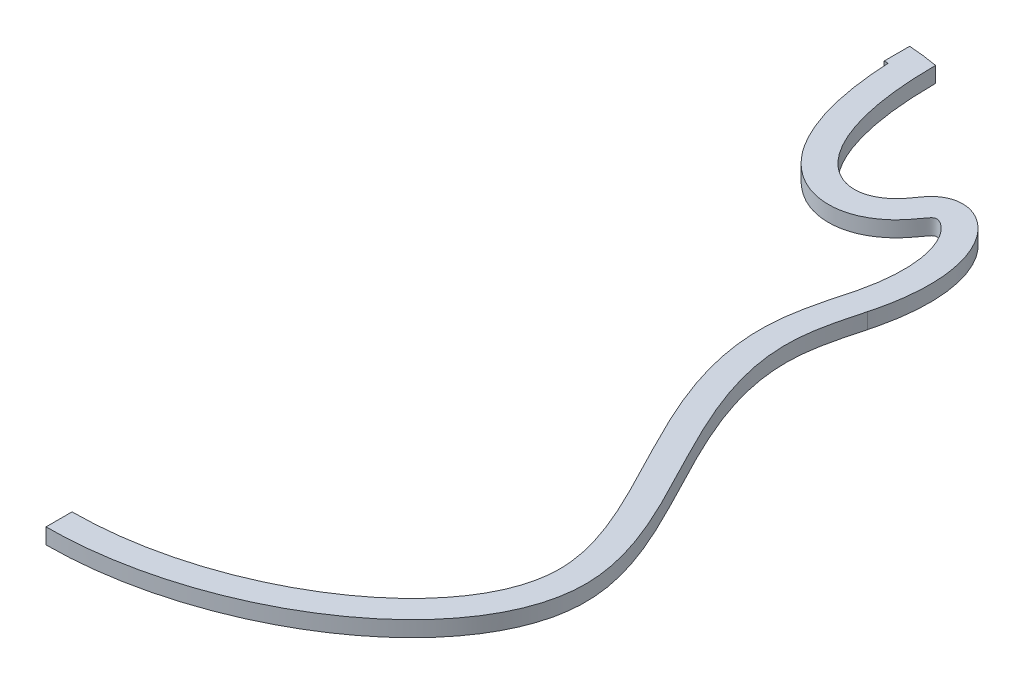
ISO-10303-21;
HEADER;
FILE_DESCRIPTION(('STEP AP214'),'2;1');
FILE_NAME('part.step','',(''),(''),'','','');
FILE_SCHEMA(('AUTOMOTIVE_DESIGN { 1 0 10303 214 1 1 1 1 }'));
ENDSEC;
DATA;
#1=APPLICATION_CONTEXT('core data for automotive mechanical design processes');
#2=APPLICATION_PROTOCOL_DEFINITION('international standard','automotive_design',2000,#1);
#3=PRODUCT_CONTEXT('',#1,'mechanical');
#4=PRODUCT('Part','Part','',(#3));
#5=PRODUCT_RELATED_PRODUCT_CATEGORY('part','',(#4));
#6=PRODUCT_DEFINITION_FORMATION('','',#4);
#7=PRODUCT_DEFINITION_CONTEXT('part definition',#1,'design');
#8=PRODUCT_DEFINITION('design','',#6,#7);
#9=PRODUCT_DEFINITION_SHAPE('','',#8);
#10=(LENGTH_UNIT() NAMED_UNIT(*) SI_UNIT(.MILLI.,.METRE.));
#11=(NAMED_UNIT(*) PLANE_ANGLE_UNIT() SI_UNIT($,.RADIAN.));
#12=(NAMED_UNIT(*) SI_UNIT($,.STERADIAN.) SOLID_ANGLE_UNIT());
#13=UNCERTAINTY_MEASURE_WITH_UNIT(LENGTH_MEASURE(1.E-05),#10,'distance_accuracy_value','');
#14=(GEOMETRIC_REPRESENTATION_CONTEXT(3) GLOBAL_UNCERTAINTY_ASSIGNED_CONTEXT((#13)) GLOBAL_UNIT_ASSIGNED_CONTEXT((#10,
#11,#12)) REPRESENTATION_CONTEXT('',''));
#15=CARTESIAN_POINT('',(0.,0.,0.));
#16=DIRECTION('',(0.,0.,1.));
#17=DIRECTION('',(1.,0.,0.));
#18=AXIS2_PLACEMENT_3D('',#15,#16,#17);
#19=CARTESIAN_POINT('',(129.25976652063,-18.,-99.5086790682164));
#20=CARTESIAN_POINT('',(126.284231927278,-18.,-88.5363418824525));
#21=CARTESIAN_POINT('',(106.021894992959,-18.,-12.6395872431965));
#22=CARTESIAN_POINT('',(262.593496584563,-18.,133.359561301695));
#23=CARTESIAN_POINT('',(91.1564395871884,-18.,244.500000000842));
#24=CARTESIAN_POINT('',(-1.94782094457688E-09,-18.,244.5));
#25=B_SPLINE_CURVE_WITH_KNOTS('',3,(#19,#20,#21,#22,#23,#24),.UNSPECIFIED.,.F.,.F.,(4,1,1,4),
(1.5,1.52506958812533,1.67238993684353,1.83966815295385),.UNSPECIFIED.);
#26=DIRECTION('',(0.,1.,0.));
#27=VECTOR('',#26,1.);
#28=SURFACE_OF_LINEAR_EXTRUSION('',#25,#27);
#29=CARTESIAN_POINT('',(129.25976652063,-9.,-99.5086790682164));
#30=CARTESIAN_POINT('',(126.284231927278,-9.,-88.5363418824525));
#31=CARTESIAN_POINT('',(106.021894992959,-9.,-12.6395872431965));
#32=CARTESIAN_POINT('',(262.593496584563,-9.,133.359561301695));
#33=CARTESIAN_POINT('',(91.1564395871884,-9.,244.500000000842));
#34=CARTESIAN_POINT('',(-1.94782094457688E-09,-9.,244.5));
#35=B_SPLINE_CURVE_WITH_KNOTS('',3,(#29,#30,#31,#32,#33,#34),.UNSPECIFIED.,.F.,.F.,(4,1,1,4),
(1.5,1.52506958812533,1.67238993684353,1.83966815295385),.UNSPECIFIED.);
#36=CARTESIAN_POINT('',(129.259766520584,-9.,-99.5086790680464));
#37=VERTEX_POINT('',#36);
#38=CARTESIAN_POINT('',(-1.95838439124744E-09,-9.,244.5));
#39=VERTEX_POINT('',#38);
#40=EDGE_CURVE('E321',#37,#39,#35,.T.);
#41=ORIENTED_EDGE('',*,*,#40,.T.);
#42=DIRECTION('',(0.,1.,0.));
#43=VECTOR('',#42,1.);
#44=CARTESIAN_POINT('',(-1.95838439124744E-09,-18.,244.5));
#45=LINE('',#44,#43);
#46=CARTESIAN_POINT('',(-1.95838439124744E-09,-18.,244.5));
#47=VERTEX_POINT('',#46);
#48=EDGE_CURVE('E44',#47,#39,#45,.T.);
#49=ORIENTED_EDGE('',*,*,#48,.F.);
#50=CARTESIAN_POINT('',(-1.94782094457688E-09,-18.,244.5));
#51=CARTESIAN_POINT('',(91.1564395871884,-18.,244.500000000842));
#52=CARTESIAN_POINT('',(262.593496584563,-18.,133.359561301695));
#53=CARTESIAN_POINT('',(106.021894992959,-18.,-12.6395872431965));
#54=CARTESIAN_POINT('',(126.284231927278,-18.,-88.5363418824525));
#55=CARTESIAN_POINT('',(129.25976652063,-18.,-99.5086790682164));
#56=B_SPLINE_CURVE_WITH_KNOTS('',3,(#50,#51,#52,#53,#54,#55),.UNSPECIFIED.,.F.,.F.,(4,1,1,4),
(1.5,1.66727821611032,1.81459856482852,1.83966815295385),.UNSPECIFIED.);
#57=CARTESIAN_POINT('',(129.25976652063,-18.,-99.5086790682165));
#58=VERTEX_POINT('',#57);
#59=EDGE_CURVE('E396',#58,#47,#56,.F.);
#60=ORIENTED_EDGE('',*,*,#59,.F.);
#61=DIRECTION('',(0.,1.,0.));
#62=VECTOR('',#61,1.);
#63=CARTESIAN_POINT('',(129.25976652063,-18.,-99.5086790682165));
#64=LINE('',#63,#62);
#65=EDGE_CURVE('E132',#58,#37,#64,.T.);
#66=ORIENTED_EDGE('',*,*,#65,.T.);
#67=EDGE_LOOP('',(#41,#49,#60,#66));
#68=FACE_BOUND('',#67,.T.);
#69=ADVANCED_FACE('F34',(#68),#28,.F.);
#70=CARTESIAN_POINT('',(3.07302241379231E-09,-18.,229.49994342044));
#71=DIRECTION('',(1.,0.,3.35425855119486E-10));
#72=DIRECTION('',(3.35425855119486E-10,0.,-1.));
#73=AXIS2_PLACEMENT_3D('',#70,#71,#72);
#74=PLANE('',#73);
#75=DIRECTION('',(3.35425855119486E-10,0.,-1.));
#76=VECTOR('',#75,1.);
#77=CARTESIAN_POINT('',(3.07302241379231E-09,-9.,229.49994342044));
#78=LINE('',#77,#76);
#79=CARTESIAN_POINT('',(3.100678655249E-09,-9.,229.499943736745));
#80=VERTEX_POINT('',#79);
#81=EDGE_CURVE('E324',#39,#80,#78,.T.);
#82=ORIENTED_EDGE('',*,*,#81,.T.);
#83=DIRECTION('',(0.,1.,0.));
#84=VECTOR('',#83,1.);
#85=CARTESIAN_POINT('',(3.100678655249E-09,-18.,229.499943736745));
#86=LINE('',#85,#84);
#87=CARTESIAN_POINT('',(3.100678655249E-09,-18.,229.499943736745));
#88=VERTEX_POINT('',#87);
#89=EDGE_CURVE('E421',#88,#80,#86,.T.);
#90=ORIENTED_EDGE('',*,*,#89,.F.);
#91=DIRECTION('',(3.35425855119486E-10,0.,-1.));
#92=VECTOR('',#91,1.);
#93=CARTESIAN_POINT('',(3.07302241379231E-09,-18.,229.49994342044));
#94=LINE('',#93,#92);
#95=EDGE_CURVE('E95',#47,#88,#94,.T.);
#96=ORIENTED_EDGE('',*,*,#95,.F.);
#97=ORIENTED_EDGE('',*,*,#48,.T.);
#98=EDGE_LOOP('',(#82,#90,#96,#97));
#99=FACE_BOUND('',#98,.T.);
#100=ADVANCED_FACE('F369',(#99),#74,.F.);
#101=CARTESIAN_POINT('',(3.100678655249E-09,-18.,229.499943736745));
#102=CARTESIAN_POINT('',(2.62824860994443,-18.,229.499880482331));
#103=CARTESIAN_POINT('',(5.25643103341403,-18.,229.447169247941));
#104=CARTESIAN_POINT('',(14.6656411830695,-18.,229.073526808484));
#105=CARTESIAN_POINT('',(21.445042594911,-18.,228.461301727981));
#106=CARTESIAN_POINT('',(41.6373083364005,-18.,225.663982985582));
#107=CARTESIAN_POINT('',(54.9044181345593,-18.,222.516176375804));
#108=CARTESIAN_POINT('',(80.254129231581,-18.,214.06891770857));
#109=CARTESIAN_POINT('',(92.3359533550663,-18.,208.769057294698));
#110=CARTESIAN_POINT('',(108.973138594005,-18.,199.568508940737));
#111=CARTESIAN_POINT('',(114.271327285729,-18.,196.293781697175));
#112=CARTESIAN_POINT('',(124.275818467097,-18.,189.397568512813));
#113=CARTESIAN_POINT('',(128.982005966662,-18.,185.776049418368));
#114=CARTESIAN_POINT('',(137.710045937306,-18.,178.262225834486));
#115=CARTESIAN_POINT('',(141.73168730555,-18.,174.369953064397));
#116=CARTESIAN_POINT('',(149.007403502542,-18.,166.397968846828));
#117=CARTESIAN_POINT('',(152.261165773445,-18.,162.318498938908));
#118=CARTESIAN_POINT('',(157.935036957146,-18.,154.059418741303));
#119=CARTESIAN_POINT('',(160.354905660096,-18.,149.880489726497));
#120=CARTESIAN_POINT('',(164.321344223071,-18.,141.500797745565));
#121=CARTESIAN_POINT('',(165.868315935311,-18.,137.30116237884));
#122=CARTESIAN_POINT('',(168.075968516735,-18.,128.921605089564));
#123=CARTESIAN_POINT('',(168.738276517968,-18.,124.742255734209));
#124=CARTESIAN_POINT('',(169.002620451903,-18.,119.514159584354));
#125=CARTESIAN_POINT('',(169.027053443345,-18.,118.470082748616));
#126=CARTESIAN_POINT('',(169.02000159976,-18.,116.356609487449));
#127=CARTESIAN_POINT('',(168.988550418034,-18.,115.289696981994));
#128=CARTESIAN_POINT('',(168.811795578068,-18.,112.056190494304));
#129=CARTESIAN_POINT('',(168.584009994845,-18.,109.856549459446));
#130=CARTESIAN_POINT('',(167.582554555664,-18.,103.119322140471));
#131=CARTESIAN_POINT('',(166.488420760944,-18.,98.4419451716354));
#132=CARTESIAN_POINT('',(163.55258085758,-18.,88.7558028113543));
#133=CARTESIAN_POINT('',(161.711615085067,-18.,83.7492027928236));
#134=CARTESIAN_POINT('',(157.447996705752,-18.,73.4718878732111));
#135=CARTESIAN_POINT('',(155.026199981385,-18.,68.201690026961));
#136=CARTESIAN_POINT('',(149.799342120671,-18.,57.4460149597861));
#137=CARTESIAN_POINT('',(146.994697523742,-18.,51.960525513859));
#138=CARTESIAN_POINT('',(141.212962985491,-18.,40.8008446147176));
#139=CARTESIAN_POINT('',(138.235974075105,-18.,35.1265815378548));
#140=CARTESIAN_POINT('',(132.325535525224,-18.,23.5962792196476));
#141=CARTESIAN_POINT('',(129.391962082706,-18.,17.7401886913417));
#142=CARTESIAN_POINT('',(123.790087911104,-18.,5.83545096081578));
#143=CARTESIAN_POINT('',(121.121431411727,-18.,-0.213352268854028));
#144=CARTESIAN_POINT('',(116.283996652994,-18.,-12.529585180222));
#145=CARTESIAN_POINT('',(114.114682839614,-18.,-18.7976465461338));
#146=CARTESIAN_POINT('',(110.537261857917,-18.,-31.5836773398188));
#147=CARTESIAN_POINT('',(109.12904731238,-18.,-38.1032539114938));
#148=CARTESIAN_POINT('',(107.374901611725,-18.,-51.396852514918));
#149=CARTESIAN_POINT('',(107.030812874349,-18.,-58.1727006563228));
#150=CARTESIAN_POINT('',(107.46520332057,-18.,-66.7518318104118));
#151=CARTESIAN_POINT('',(107.596895847506,-18.,-68.4784123223447));
#152=CARTESIAN_POINT('',(107.939643542977,-18.,-71.8848373413438));
#153=CARTESIAN_POINT('',(108.149839944193,-18.,-73.5702237320242));
#154=CARTESIAN_POINT('',(108.875167294476,-18.,-78.5732175667496));
#155=CARTESIAN_POINT('',(109.484596746614,-18.,-81.8376164262568));
#156=CARTESIAN_POINT('',(110.850415983421,-18.,-88.2318574903697));
#157=CARTESIAN_POINT('',(111.606932107529,-18.,-91.361954716058));
#158=CARTESIAN_POINT('',(113.174584734829,-18.,-97.4941069969312));
#159=CARTESIAN_POINT('',(113.985807700646,-18.,-100.496261378222));
#160=CARTESIAN_POINT('',(114.782555709052,-18.,-103.434283094093));
#161=B_SPLINE_CURVE_WITH_KNOTS('',3,(#101,#102,#103,#104,#105,#106,#107,#108,#109,#110,#111,
#112,#113,#114,#115,#116,#117,#118,#119,#120,#121,#122,#123,#124,#125,#126,#127,#128,#129,#130,
#131,#132,#133,#134,#135,#136,#137,#138,#139,#140,#141,#142,#143,#144,#145,#146,#147,#148,#149,
#150,#151,#152,#153,#154,#155,#156,#157,#158,#159,#160),.UNSPECIFIED.,.F.,.F.,(4,2,2,2,2,2,2,2,
2,2,2,2,2,2,2,2,2,2,2,2,2,2,2,2,2,2,2,2,2,4),(0.603313859270765,0.609374999999995,
0.624999999999995,0.656249999999996,0.687499999999996,0.703124999999996,0.718749999999996,
0.734374999999996,0.749999999999996,0.765624999999996,0.781249999999996,0.796874999999996,
0.800781249999996,0.804687499999997,0.812499999999997,0.828124999999997,0.843749999999997,
0.859374999999998,0.874999999999998,0.890624999999998,0.906249999999998,0.921874999999999,
0.937499999999999,0.953124999999999,0.96875,0.97265625,0.9765625,0.984375,0.9921875,1.),.UNSPECIFIED.);
#162=DIRECTION('',(0.,1.,0.));
#163=VECTOR('',#162,1.);
#164=SURFACE_OF_LINEAR_EXTRUSION('',#161,#163);
#165=CARTESIAN_POINT('',(3.100678655249E-09,-9.,229.499943736745));
#166=CARTESIAN_POINT('',(2.62824860994443,-9.,229.499880482331));
#167=CARTESIAN_POINT('',(5.25643103341403,-9.,229.447169247941));
#168=CARTESIAN_POINT('',(14.6656411830695,-9.,229.073526808484));
#169=CARTESIAN_POINT('',(21.445042594911,-9.,228.461301727981));
#170=CARTESIAN_POINT('',(41.6373083364005,-9.,225.663982985582));
#171=CARTESIAN_POINT('',(54.9044181345593,-9.,222.516176375804));
#172=CARTESIAN_POINT('',(80.254129231581,-9.,214.06891770857));
#173=CARTESIAN_POINT('',(92.3359533550663,-9.,208.769057294698));
#174=CARTESIAN_POINT('',(108.973138594005,-9.,199.568508940737));
#175=CARTESIAN_POINT('',(114.271327285729,-9.,196.293781697175));
#176=CARTESIAN_POINT('',(124.275818467097,-9.,189.397568512813));
#177=CARTESIAN_POINT('',(128.982005966662,-9.,185.776049418368));
#178=CARTESIAN_POINT('',(137.710045937306,-9.,178.262225834486));
#179=CARTESIAN_POINT('',(141.73168730555,-9.,174.369953064397));
#180=CARTESIAN_POINT('',(149.007403502542,-9.,166.397968846828));
#181=CARTESIAN_POINT('',(152.261165773445,-9.,162.318498938908));
#182=CARTESIAN_POINT('',(157.935036957146,-9.,154.059418741303));
#183=CARTESIAN_POINT('',(160.354905660096,-9.,149.880489726497));
#184=CARTESIAN_POINT('',(164.321344223071,-9.,141.500797745565));
#185=CARTESIAN_POINT('',(165.868315935311,-9.,137.30116237884));
#186=CARTESIAN_POINT('',(168.075968516735,-9.,128.921605089564));
#187=CARTESIAN_POINT('',(168.738276517968,-9.,124.742255734209));
#188=CARTESIAN_POINT('',(169.002620451903,-9.,119.514159584354));
#189=CARTESIAN_POINT('',(169.027053443345,-9.,118.470082748616));
#190=CARTESIAN_POINT('',(169.02000159976,-9.,116.356609487449));
#191=CARTESIAN_POINT('',(168.988550418034,-9.,115.289696981994));
#192=CARTESIAN_POINT('',(168.811795578068,-9.,112.056190494304));
#193=CARTESIAN_POINT('',(168.584009994845,-9.,109.856549459446));
#194=CARTESIAN_POINT('',(167.582554555664,-9.,103.119322140471));
#195=CARTESIAN_POINT('',(166.488420760944,-9.,98.4419451716354));
#196=CARTESIAN_POINT('',(163.55258085758,-9.,88.7558028113543));
#197=CARTESIAN_POINT('',(161.711615085067,-9.,83.7492027928236));
#198=CARTESIAN_POINT('',(157.447996705752,-9.,73.4718878732111));
#199=CARTESIAN_POINT('',(155.026199981385,-9.,68.201690026961));
#200=CARTESIAN_POINT('',(149.799342120671,-9.,57.4460149597861));
#201=CARTESIAN_POINT('',(146.994697523742,-9.,51.960525513859));
#202=CARTESIAN_POINT('',(141.212962985491,-9.,40.8008446147176));
#203=CARTESIAN_POINT('',(138.235974075105,-9.,35.1265815378548));
#204=CARTESIAN_POINT('',(132.325535525224,-9.,23.5962792196476));
#205=CARTESIAN_POINT('',(129.391962082706,-9.,17.7401886913417));
#206=CARTESIAN_POINT('',(123.790087911104,-9.,5.83545096081578));
#207=CARTESIAN_POINT('',(121.121431411727,-9.,-0.213352268854028));
#208=CARTESIAN_POINT('',(116.283996652994,-9.,-12.529585180222));
#209=CARTESIAN_POINT('',(114.114682839614,-9.,-18.7976465461338));
#210=CARTESIAN_POINT('',(110.537261857917,-9.,-31.5836773398188));
#211=CARTESIAN_POINT('',(109.12904731238,-9.,-38.1032539114938));
#212=CARTESIAN_POINT('',(107.374901611725,-9.,-51.396852514918));
#213=CARTESIAN_POINT('',(107.030812874349,-9.,-58.1727006563228));
#214=CARTESIAN_POINT('',(107.46520332057,-9.,-66.7518318104118));
#215=CARTESIAN_POINT('',(107.596895847506,-9.,-68.4784123223447));
#216=CARTESIAN_POINT('',(107.939643542977,-9.,-71.8848373413438));
#217=CARTESIAN_POINT('',(108.149839944193,-9.,-73.5702237320242));
#218=CARTESIAN_POINT('',(108.875167294476,-9.,-78.5732175667496));
#219=CARTESIAN_POINT('',(109.484596746614,-9.,-81.8376164262568));
#220=CARTESIAN_POINT('',(110.850415983421,-9.,-88.2318574903697));
#221=CARTESIAN_POINT('',(111.606932107529,-9.,-91.361954716058));
#222=CARTESIAN_POINT('',(113.174584734829,-9.,-97.4941069969312));
#223=CARTESIAN_POINT('',(113.985807700646,-9.,-100.496261378222));
#224=CARTESIAN_POINT('',(114.782555709052,-9.,-103.434283094093));
#225=B_SPLINE_CURVE_WITH_KNOTS('',3,(#165,#166,#167,#168,#169,#170,#171,#172,#173,#174,#175,
#176,#177,#178,#179,#180,#181,#182,#183,#184,#185,#186,#187,#188,#189,#190,#191,#192,#193,#194,
#195,#196,#197,#198,#199,#200,#201,#202,#203,#204,#205,#206,#207,#208,#209,#210,#211,#212,#213,
#214,#215,#216,#217,#218,#219,#220,#221,#222,#223,#224),.UNSPECIFIED.,.F.,.F.,(4,2,2,2,2,2,2,2,
2,2,2,2,2,2,2,2,2,2,2,2,2,2,2,2,2,2,2,2,2,4),(0.603313859270765,0.609374999999995,
0.624999999999995,0.656249999999996,0.687499999999996,0.703124999999996,0.718749999999996,
0.734374999999996,0.749999999999996,0.765624999999996,0.781249999999996,0.796874999999996,
0.800781249999996,0.804687499999997,0.812499999999997,0.828124999999997,0.843749999999997,
0.859374999999998,0.874999999999998,0.890624999999998,0.906249999999998,0.921874999999999,
0.937499999999999,0.953124999999999,0.96875,0.97265625,0.9765625,0.984375,0.9921875,1.),.UNSPECIFIED.);
#226=CARTESIAN_POINT('',(114.782555709052,-9.,-103.434283094093));
#227=VERTEX_POINT('',#226);
#228=EDGE_CURVE('E387',#80,#227,#225,.T.);
#229=ORIENTED_EDGE('',*,*,#228,.T.);
#230=DIRECTION('',(0.,1.,0.));
#231=VECTOR('',#230,1.);
#232=CARTESIAN_POINT('',(114.782555709052,-18.,-103.434283094093));
#233=LINE('',#232,#231);
#234=CARTESIAN_POINT('',(114.782555709052,-18.,-103.434283094093));
#235=VERTEX_POINT('',#234);
#236=EDGE_CURVE('E131',#235,#227,#233,.T.);
#237=ORIENTED_EDGE('',*,*,#236,.F.);
#238=CARTESIAN_POINT('',(114.782555709052,-18.,-103.434283094093));
#239=CARTESIAN_POINT('',(113.985807700646,-18.,-100.496261378222));
#240=CARTESIAN_POINT('',(113.174584734829,-18.,-97.4941069969312));
#241=CARTESIAN_POINT('',(111.606932107529,-18.,-91.361954716058));
#242=CARTESIAN_POINT('',(110.850415983421,-18.,-88.2318574903697));
#243=CARTESIAN_POINT('',(109.484596746614,-18.,-81.8376164262568));
#244=CARTESIAN_POINT('',(108.875167294476,-18.,-78.5732175667496));
#245=CARTESIAN_POINT('',(108.149839944193,-18.,-73.5702237320242));
#246=CARTESIAN_POINT('',(107.939643542977,-18.,-71.8848373413438));
#247=CARTESIAN_POINT('',(107.596895847506,-18.,-68.4784123223447));
#248=CARTESIAN_POINT('',(107.46520332057,-18.,-66.7518318104118));
#249=CARTESIAN_POINT('',(107.030812874349,-18.,-58.1727006563228));
#250=CARTESIAN_POINT('',(107.374901611725,-18.,-51.396852514918));
#251=CARTESIAN_POINT('',(109.12904731238,-18.,-38.1032539114938));
#252=CARTESIAN_POINT('',(110.537261857917,-18.,-31.5836773398188));
#253=CARTESIAN_POINT('',(114.114682839614,-18.,-18.7976465461338));
#254=CARTESIAN_POINT('',(116.283996652994,-18.,-12.529585180222));
#255=CARTESIAN_POINT('',(121.121431411727,-18.,-0.213352268854028));
#256=CARTESIAN_POINT('',(123.790087911104,-18.,5.83545096081578));
#257=CARTESIAN_POINT('',(129.391962082706,-18.,17.7401886913417));
#258=CARTESIAN_POINT('',(132.325535525224,-18.,23.5962792196476));
#259=CARTESIAN_POINT('',(138.235974075105,-18.,35.1265815378548));
#260=CARTESIAN_POINT('',(141.212962985491,-18.,40.8008446147176));
#261=CARTESIAN_POINT('',(146.994697523742,-18.,51.960525513859));
#262=CARTESIAN_POINT('',(149.799342120671,-18.,57.4460149597861));
#263=CARTESIAN_POINT('',(155.026199981385,-18.,68.201690026961));
#264=CARTESIAN_POINT('',(157.447996705752,-18.,73.4718878732111));
#265=CARTESIAN_POINT('',(161.711615085067,-18.,83.7492027928236));
#266=CARTESIAN_POINT('',(163.55258085758,-18.,88.7558028113543));
#267=CARTESIAN_POINT('',(166.488420760944,-18.,98.4419451716354));
#268=CARTESIAN_POINT('',(167.582554555664,-18.,103.119322140471));
#269=CARTESIAN_POINT('',(168.584009994845,-18.,109.856549459446));
#270=CARTESIAN_POINT('',(168.811795578068,-18.,112.056190494304));
#271=CARTESIAN_POINT('',(168.988550418034,-18.,115.289696981994));
#272=CARTESIAN_POINT('',(169.02000159976,-18.,116.356609487449));
#273=CARTESIAN_POINT('',(169.027053443345,-18.,118.470082748616));
#274=CARTESIAN_POINT('',(169.002620451903,-18.,119.514159584354));
#275=CARTESIAN_POINT('',(168.738276517968,-18.,124.742255734209));
#276=CARTESIAN_POINT('',(168.075968516735,-18.,128.921605089564));
#277=CARTESIAN_POINT('',(165.868315935311,-18.,137.30116237884));
#278=CARTESIAN_POINT('',(164.321344223071,-18.,141.500797745565));
#279=CARTESIAN_POINT('',(160.354905660096,-18.,149.880489726497));
#280=CARTESIAN_POINT('',(157.935036957146,-18.,154.059418741303));
#281=CARTESIAN_POINT('',(152.261165773445,-18.,162.318498938908));
#282=CARTESIAN_POINT('',(149.007403502542,-18.,166.397968846828));
#283=CARTESIAN_POINT('',(141.73168730555,-18.,174.369953064397));
#284=CARTESIAN_POINT('',(137.710045937306,-18.,178.262225834486));
#285=CARTESIAN_POINT('',(128.982005966662,-18.,185.776049418368));
#286=CARTESIAN_POINT('',(124.275818467097,-18.,189.397568512813));
#287=CARTESIAN_POINT('',(114.271327285729,-18.,196.293781697175));
#288=CARTESIAN_POINT('',(108.973138594005,-18.,199.568508940737));
#289=CARTESIAN_POINT('',(92.3359533550663,-18.,208.769057294698));
#290=CARTESIAN_POINT('',(80.254129231581,-18.,214.06891770857));
#291=CARTESIAN_POINT('',(54.9044181345593,-18.,222.516176375804));
#292=CARTESIAN_POINT('',(41.6373083364005,-18.,225.663982985582));
#293=CARTESIAN_POINT('',(21.445042594911,-18.,228.461301727981));
#294=CARTESIAN_POINT('',(14.6656411830695,-18.,229.073526808484));
#295=CARTESIAN_POINT('',(5.25643103341403,-18.,229.447169247941));
#296=CARTESIAN_POINT('',(2.62824860994443,-18.,229.499880482331));
#297=CARTESIAN_POINT('',(3.100678655249E-09,-18.,229.499943736745));
#298=B_SPLINE_CURVE_WITH_KNOTS('',3,(#238,#239,#240,#241,#242,#243,#244,#245,#246,#247,#248,
#249,#250,#251,#252,#253,#254,#255,#256,#257,#258,#259,#260,#261,#262,#263,#264,#265,#266,#267,
#268,#269,#270,#271,#272,#273,#274,#275,#276,#277,#278,#279,#280,#281,#282,#283,#284,#285,#286,
#287,#288,#289,#290,#291,#292,#293,#294,#295,#296,#297),.UNSPECIFIED.,.F.,.F.,(4,2,2,2,2,2,2,2,
2,2,2,2,2,2,2,2,2,2,2,2,2,2,2,2,2,2,2,2,2,4),(0.603313859270765,0.611126359270765,
0.618938859270765,0.626751359270765,0.630657609270765,0.634563859270766,0.650188859270766,
0.665813859270766,0.681438859270766,0.697063859270767,0.712688859270767,0.728313859270767,
0.743938859270768,0.759563859270768,0.775188859270768,0.790813859270769,0.798626359270769,
0.802532609270769,0.806438859270769,0.822063859270769,0.837688859270769,0.853313859270769,
0.868938859270769,0.884563859270769,0.900188859270769,0.91581385927077,0.94706385927077,
0.97831385927077,0.99393885927077,1.),.UNSPECIFIED.);
#299=EDGE_CURVE('E117',#88,#235,#298,.F.);
#300=ORIENTED_EDGE('',*,*,#299,.F.);
#301=ORIENTED_EDGE('',*,*,#89,.T.);
#302=EDGE_LOOP('',(#229,#237,#300,#301));
#303=FACE_BOUND('',#302,.T.);
#304=ADVANCED_FACE('F366',(#303),#164,.F.);
#305=CARTESIAN_POINT('',(114.782555709052,-18.,-103.434283094093));
#306=DIRECTION('',(0.969259744774996,0.,0.246039726789616));
#307=DIRECTION('',(0.246039726789616,0.,-0.969259744774996));
#308=AXIS2_PLACEMENT_3D('',#305,#306,#307);
#309=PLANE('',#308);
#310=DIRECTION('',(0.246039726789616,0.,-0.969259744774996));
#311=VECTOR('',#310,1.);
#312=CARTESIAN_POINT('',(114.782555709052,-9.,-103.434283094093));
#313=LINE('',#312,#311);
#314=CARTESIAN_POINT('',(115.849839435811,-9.,-107.638787651545));
#315=VERTEX_POINT('',#314);
#316=EDGE_CURVE('E127',#227,#315,#313,.T.);
#317=ORIENTED_EDGE('',*,*,#316,.T.);
#318=DIRECTION('',(0.,1.,0.));
#319=VECTOR('',#318,1.);
#320=CARTESIAN_POINT('',(115.849839435811,-18.,-107.638787651545));
#321=LINE('',#320,#319);
#322=CARTESIAN_POINT('',(115.849839435811,-18.,-107.638787651545));
#323=VERTEX_POINT('',#322);
#324=EDGE_CURVE('E124',#323,#315,#321,.T.);
#325=ORIENTED_EDGE('',*,*,#324,.F.);
#326=DIRECTION('',(0.246039726789616,0.,-0.969259744774996));
#327=VECTOR('',#326,1.);
#328=CARTESIAN_POINT('',(114.782555709052,-18.,-103.434283094093));
#329=LINE('',#328,#327);
#330=EDGE_CURVE('E106',#235,#323,#329,.T.);
#331=ORIENTED_EDGE('',*,*,#330,.F.);
#332=ORIENTED_EDGE('',*,*,#236,.T.);
#333=EDGE_LOOP('',(#317,#325,#331,#332));
#334=FACE_BOUND('',#333,.T.);
#335=ADVANCED_FACE('F125',(#334),#309,.F.);
#336=CARTESIAN_POINT('',(184.015415659623,-18.,116.474370173728));
#337=DIRECTION('',(0.,-1.,0.));
#338=DIRECTION('',(0.,0.,-1.));
#339=AXIS2_PLACEMENT_3D('',#336,#337,#338);
#340=PLANE('',#339);
#341=DIRECTION('',(0.,0.,1.));
#342=VECTOR('',#341,1.);
#343=CARTESIAN_POINT('',(9.00000000000001,-18.,116.474370173728));
#344=LINE('',#343,#342);
#345=CARTESIAN_POINT('',(8.99999994569265,-18.,-244.212098321326));
#346=VERTEX_POINT('',#345);
#347=CARTESIAN_POINT('',(9.00000000000001,-18.,-229.500000000004));
#348=VERTEX_POINT('',#347);
#349=EDGE_CURVE('E308',#346,#348,#344,.T.);
#350=ORIENTED_EDGE('',*,*,#349,.F.);
#351=CARTESIAN_POINT('',(26.,-18.,-242.13340875045));
#352=CARTESIAN_POINT('',(20.3810200069471,-18.,-243.146996796519));
#353=CARTESIAN_POINT('',(14.7010041417676,-18.,-243.848655262685));
#354=CARTESIAN_POINT('',(8.99996180620196,-18.,-244.211800586866));
#355=B_SPLINE_CURVE_WITH_KNOTS('',3,(#351,#352,#353,#354),.UNSPECIFIED.,.F.,.F.,(4,4),
(0.989120665639575,1.),.UNSPECIFIED.);
#356=CARTESIAN_POINT('',(26.0000000000001,-18.,-242.13340875045));
#357=VERTEX_POINT('',#356);
#358=EDGE_CURVE('E213',#346,#357,#355,.F.);
#359=ORIENTED_EDGE('',*,*,#358,.T.);
#360=CARTESIAN_POINT('',(130.390460752244,-18.,-103.947764014138));
#361=CARTESIAN_POINT('',(145.379346587903,-18.,-166.902335596422));
#362=CARTESIAN_POINT('',(102.770026623229,-18.,-197.295175864336));
#363=CARTESIAN_POINT('',(68.30434893661,-18.,-141.462594008386));
#364=CARTESIAN_POINT('',(26.0016673167794,-18.,-158.206139437614));
#365=CARTESIAN_POINT('',(26.0000000000001,-18.,-242.13340875045));
#366=B_SPLINE_CURVE_WITH_KNOTS('',3,(#360,#361,#362,#363,#364,#365),.UNSPECIFIED.,.F.,.F.,(4,1,
1,4),(0.,0.441220165607539,0.487718356931132,0.989753040085366),.UNSPECIFIED.);
#367=CARTESIAN_POINT('',(130.390556957844,-18.,-103.947736036382));
#368=VERTEX_POINT('',#367);
#369=EDGE_CURVE('E232',#357,#368,#366,.F.);
#370=ORIENTED_EDGE('',*,*,#369,.T.);
#371=CARTESIAN_POINT('',(129.25976652063,-18.,-99.5086790682165));
#372=CARTESIAN_POINT('',(129.666104515765,-18.,-101.007363210624));
#373=CARTESIAN_POINT('',(130.042692390063,-18.,-102.487107865906));
#374=CARTESIAN_POINT('',(130.390460752244,-18.,-103.947764014138));
#375=B_SPLINE_CURVE_WITH_KNOTS('',3,(#371,#372,#373,#374),.UNSPECIFIED.,.F.,.F.,(4,4),
(0.989753040085366,0.999990119481195),.UNSPECIFIED.);
#376=EDGE_CURVE('E59',#368,#58,#375,.F.);
#377=ORIENTED_EDGE('',*,*,#376,.T.);
#378=ORIENTED_EDGE('',*,*,#59,.T.);
#379=ORIENTED_EDGE('',*,*,#95,.T.);
#380=ORIENTED_EDGE('',*,*,#299,.T.);
#381=ORIENTED_EDGE('',*,*,#330,.T.);
#382=CARTESIAN_POINT('',(11.2924406809671,-18.,-229.500000000006));
#383=CARTESIAN_POINT('',(11.5869340737732,-18.,-223.315318973361));
#384=CARTESIAN_POINT('',(12.0999056889399,-18.,-217.48450762452));
#385=CARTESIAN_POINT('',(13.9950434707877,-18.,-202.893487376905));
#386=CARTESIAN_POINT('',(15.7252850658832,-18.,-194.72006491958));
#387=CARTESIAN_POINT('',(19.0668113879706,-18.,-183.733125993236));
#388=CARTESIAN_POINT('',(20.3056192235652,-18.,-180.283041059383));
#389=CARTESIAN_POINT('',(23.0298531230134,-18.,-173.792363981061));
#390=CARTESIAN_POINT('',(24.5152684121921,-18.,-170.751573879115));
#391=CARTESIAN_POINT('',(27.737302932541,-18.,-165.071888941284));
#392=CARTESIAN_POINT('',(29.4740619597176,-18.,-162.432684167748));
#393=CARTESIAN_POINT('',(33.2099479814207,-18.,-157.563745996599));
#394=CARTESIAN_POINT('',(35.2095518943157,-18.,-155.333685140925));
#395=CARTESIAN_POINT('',(39.4803905705949,-18.,-151.315931643264));
#396=CARTESIAN_POINT('',(41.752546375154,-18.,-149.528276844338));
#397=CARTESIAN_POINT('',(46.5549730251641,-18.,-146.459751263868));
#398=CARTESIAN_POINT('',(49.0861306098653,-18.,-145.179867710204));
#399=CARTESIAN_POINT('',(54.340348970006,-18.,-143.209514081049));
#400=CARTESIAN_POINT('',(57.0630231307166,-18.,-142.520777319756));
#401=CARTESIAN_POINT('',(62.5689221129843,-18.,-141.790333628336));
#402=CARTESIAN_POINT('',(65.3501749091662,-18.,-141.749411412595));
#403=CARTESIAN_POINT('',(70.8132942496094,-18.,-142.30221511412));
#404=CARTESIAN_POINT('',(73.493493314568,-18.,-142.894849105175));
#405=CARTESIAN_POINT('',(78.628897118409,-18.,-144.635972258672));
#406=CARTESIAN_POINT('',(81.084089561515,-18.,-145.782914547655));
#407=CARTESIAN_POINT('',(85.7062919378982,-18.,-148.533617386897));
#408=CARTESIAN_POINT('',(87.8741700530271,-18.,-150.136672640482));
#409=CARTESIAN_POINT('',(91.9040946261355,-18.,-153.717648905415));
#410=CARTESIAN_POINT('',(93.7668775942215,-18.,-155.695599767282));
#411=CARTESIAN_POINT('',(95.6908178875523,-18.,-158.100184893316));
#412=CARTESIAN_POINT('',(95.9038537715021,-18.,-158.372182490641));
#413=CARTESIAN_POINT('',(96.3098481715798,-18.,-158.90028137646));
#414=CARTESIAN_POINT('',(96.5044433291339,-18.,-159.158223261994));
#415=CARTESIAN_POINT('',(97.0658055663929,-18.,-159.912415269808));
#416=CARTESIAN_POINT('',(97.410331324102,-18.,-160.389060132572));
#417=CARTESIAN_POINT('',(98.3700998531097,-18.,-161.729810892758));
#418=CARTESIAN_POINT('',(98.9143014353534,-18.,-162.505442555424));
#419=CARTESIAN_POINT('',(99.8252439308794,-18.,-163.749304004029));
#420=CARTESIAN_POINT('',(100.19278481821,-18.,-164.215983636481));
#421=CARTESIAN_POINT('',(100.488127148293,-18.,-164.559144922632));
#422=CARTESIAN_POINT('',(100.537273387264,-18.,-164.614363577042));
#423=CARTESIAN_POINT('',(100.637971457815,-18.,-164.724278100945));
#424=CARTESIAN_POINT('',(100.687201112945,-18.,-164.776264856387));
#425=CARTESIAN_POINT('',(100.831380089085,-18.,-164.92387619409));
#426=CARTESIAN_POINT('',(100.922802041851,-18.,-165.011148245705));
#427=CARTESIAN_POINT('',(101.182351780582,-18.,-165.244240074113));
#428=CARTESIAN_POINT('',(101.33545765436,-18.,-165.361382650135));
#429=CARTESIAN_POINT('',(101.605471118434,-18.,-165.544423230372));
#430=CARTESIAN_POINT('',(101.722419432902,-18.,-165.610477858933));
#431=CARTESIAN_POINT('',(101.933065501409,-18.,-165.713436721259));
#432=CARTESIAN_POINT('',(102.026894681578,-18.,-165.750458407265));
#433=CARTESIAN_POINT('',(102.211012942895,-18.,-165.809646879699));
#434=CARTESIAN_POINT('',(102.301475183226,-18.,-165.831839502026));
#435=CARTESIAN_POINT('',(102.500531942507,-18.,-165.865551965879));
#436=CARTESIAN_POINT('',(102.609270025731,-18.,-165.877004018876));
#437=CARTESIAN_POINT('',(102.863491977544,-18.,-165.883980800394));
#438=CARTESIAN_POINT('',(103.009044759685,-18.,-165.879388763195));
#439=CARTESIAN_POINT('',(103.519175651639,-18.,-165.82413607375));
#440=CARTESIAN_POINT('',(103.96039970207,-18.,-165.731611690599));
#441=CARTESIAN_POINT('',(105.058961494588,-18.,-165.319687010746));
#442=CARTESIAN_POINT('',(105.714452403009,-18.,-164.999034158574));
#443=CARTESIAN_POINT('',(107.178186497817,-18.,-164.037333214062));
#444=CARTESIAN_POINT('',(107.985205206945,-18.,-163.396489649014));
#445=CARTESIAN_POINT('',(109.66438112804,-18.,-161.740998091907));
#446=CARTESIAN_POINT('',(110.536104474246,-18.,-160.726806513057));
#447=CARTESIAN_POINT('',(112.257295225006,-18.,-158.297534515659));
#448=CARTESIAN_POINT('',(113.106703933067,-18.,-156.882763803328));
#449=CARTESIAN_POINT('',(115.49953999157,-18.,-152.017206407973));
#450=CARTESIAN_POINT('',(116.885971803279,-18.,-147.943581324924));
#451=CARTESIAN_POINT('',(118.647107616907,-18.,-138.101529875993));
#452=CARTESIAN_POINT('',(119.02274185639,-18.,-132.333800255078));
#453=CARTESIAN_POINT('',(118.279033652979,-18.,-120.265650807786));
#454=CARTESIAN_POINT('',(117.406849729011,-18.,-114.229883507306));
#455=CARTESIAN_POINT('',(115.849839435811,-18.,-107.638787651545));
#456=B_SPLINE_CURVE_WITH_KNOTS('',3,(#382,#383,#384,#385,#386,#387,#388,#389,#390,#391,#392,
#393,#394,#395,#396,#397,#398,#399,#400,#401,#402,#403,#404,#405,#406,#407,#408,#409,#410,#411,
#412,#413,#414,#415,#416,#417,#418,#419,#420,#421,#422,#423,#424,#425,#426,#427,#428,#429,#430,
#431,#432,#433,#434,#435,#436,#437,#438,#439,#440,#441,#442,#443,#444,#445,#446,#447,#448,#449,
#450,#451,#452,#453,#454,#455),.UNSPECIFIED.,.F.,.F.,(4,2,2,2,2,2,2,2,2,2,2,2,2,2,2,2,2,2,2,2,2,
2,2,2,2,2,2,2,2,2,2,2,2,2,2,2,4),(0.0108037008787825,0.0485451141058859,0.111045114105891,
0.142295114105893,0.173545114105895,0.204795114105898,0.2360451141059,0.267295114105902,
0.298545114105905,0.329795114105907,0.36104511410591,0.392295114105912,0.423545114105914,
0.454795114105917,0.486045114105919,0.48995136410592,0.49385761410592,0.501670114105921,
0.517295114105924,0.532920114105926,0.536826364105927,0.540732614105927,0.548545114105928,
0.564170114105926,0.579795114105925,0.595420114105924,0.611045114105923,0.626670114105922,
0.642295114105921,0.673545114105917,0.704795114105914,0.73604511410591,0.767295114105907,
0.798545114105903,0.861045114105896,0.923545114105888,0.975241413227099),.UNSPECIFIED.);
#457=CARTESIAN_POINT('',(11.2924406809672,-18.,-229.500000000006));
#458=VERTEX_POINT('',#457);
#459=EDGE_CURVE('E113',#323,#458,#456,.F.);
#460=ORIENTED_EDGE('',*,*,#459,.T.);
#461=DIRECTION('',(-1.,0.,4.9157797503262E-13));
#462=VECTOR('',#461,1.);
#463=CARTESIAN_POINT('',(11.2924406809672,-18.,-229.500000000006));
#464=LINE('',#463,#462);
#465=EDGE_CURVE('E138',#458,#348,#464,.T.);
#466=ORIENTED_EDGE('',*,*,#465,.T.);
#467=EDGE_LOOP('',(#350,#359,#370,#377,#378,#379,#380,#381,#460,#466));
#468=FACE_BOUND('',#467,.T.);
#469=ADVANCED_FACE('F109',(#468),#340,.T.);
#470=CARTESIAN_POINT('',(184.015415659623,-9.,116.474370173728));
#471=DIRECTION('',(0.,-1.,0.));
#472=DIRECTION('',(0.,0.,-1.));
#473=AXIS2_PLACEMENT_3D('',#470,#471,#472);
#474=PLANE('',#473);
#475=CARTESIAN_POINT('',(8.99996188039084,-9.,-244.21180058214));
#476=CARTESIAN_POINT('',(14.7010041910444,-9.,-243.848655256598));
#477=CARTESIAN_POINT('',(20.3810200313208,-9.,-243.146996792122));
#478=CARTESIAN_POINT('',(26.,-9.,-242.13340875045));
#479=B_SPLINE_CURVE_WITH_KNOTS('',3,(#475,#476,#477,#478),.UNSPECIFIED.,.F.,.F.,(4,4),
(0.989120665686767,1.),.UNSPECIFIED.);
#480=CARTESIAN_POINT('',(8.99999994569219,-9.,-244.212098321323));
#481=VERTEX_POINT('',#480);
#482=CARTESIAN_POINT('',(26.0000000000001,-9.,-242.13340875045));
#483=VERTEX_POINT('',#482);
#484=EDGE_CURVE('E242',#481,#483,#479,.T.);
#485=ORIENTED_EDGE('',*,*,#484,.F.);
#486=DIRECTION('',(0.,0.,1.));
#487=VECTOR('',#486,1.);
#488=CARTESIAN_POINT('',(9.00000000000001,-9.,116.474370173728));
#489=LINE('',#488,#487);
#490=CARTESIAN_POINT('',(9.00000000000001,-9.,-229.500000000004));
#491=VERTEX_POINT('',#490);
#492=EDGE_CURVE('E51',#481,#491,#489,.T.);
#493=ORIENTED_EDGE('',*,*,#492,.T.);
#494=DIRECTION('',(-1.,0.,4.9157797503262E-13));
#495=VECTOR('',#494,1.);
#496=CARTESIAN_POINT('',(11.2924406809672,-9.,-229.500000000006));
#497=LINE('',#496,#495);
#498=CARTESIAN_POINT('',(11.2924406809672,-9.,-229.500000000006));
#499=VERTEX_POINT('',#498);
#500=EDGE_CURVE('E246',#499,#491,#497,.T.);
#501=ORIENTED_EDGE('',*,*,#500,.F.);
#502=CARTESIAN_POINT('',(115.849839435811,-9.,-107.638787651545));
#503=CARTESIAN_POINT('',(117.406849729011,-9.,-114.229883507306));
#504=CARTESIAN_POINT('',(118.279033652979,-9.,-120.265650807786));
#505=CARTESIAN_POINT('',(119.02274185639,-9.,-132.333800255078));
#506=CARTESIAN_POINT('',(118.647107616907,-9.,-138.101529875993));
#507=CARTESIAN_POINT('',(116.885971803279,-9.,-147.943581324924));
#508=CARTESIAN_POINT('',(115.49953999157,-9.,-152.017206407973));
#509=CARTESIAN_POINT('',(113.106703933067,-9.,-156.882763803328));
#510=CARTESIAN_POINT('',(112.257295225006,-9.,-158.297534515659));
#511=CARTESIAN_POINT('',(110.536104474246,-9.,-160.726806513057));
#512=CARTESIAN_POINT('',(109.66438112804,-9.,-161.740998091907));
#513=CARTESIAN_POINT('',(107.985205206945,-9.,-163.396489649014));
#514=CARTESIAN_POINT('',(107.178186497817,-9.,-164.037333214062));
#515=CARTESIAN_POINT('',(105.714452403009,-9.,-164.999034158574));
#516=CARTESIAN_POINT('',(105.058961494588,-9.,-165.319687010746));
#517=CARTESIAN_POINT('',(103.96039970207,-9.,-165.731611690599));
#518=CARTESIAN_POINT('',(103.519175651639,-9.,-165.82413607375));
#519=CARTESIAN_POINT('',(103.009044759685,-9.,-165.879388763195));
#520=CARTESIAN_POINT('',(102.863491977544,-9.,-165.883980800394));
#521=CARTESIAN_POINT('',(102.609270025731,-9.,-165.877004018876));
#522=CARTESIAN_POINT('',(102.500531942507,-9.,-165.865551965879));
#523=CARTESIAN_POINT('',(102.301475183226,-9.,-165.831839502026));
#524=CARTESIAN_POINT('',(102.211012942895,-9.,-165.809646879699));
#525=CARTESIAN_POINT('',(102.026894681578,-9.,-165.750458407265));
#526=CARTESIAN_POINT('',(101.933065501409,-9.,-165.713436721259));
#527=CARTESIAN_POINT('',(101.722419432902,-9.,-165.610477858933));
#528=CARTESIAN_POINT('',(101.605471118434,-9.,-165.544423230372));
#529=CARTESIAN_POINT('',(101.33545765436,-9.,-165.361382650135));
#530=CARTESIAN_POINT('',(101.182351780582,-9.,-165.244240074113));
#531=CARTESIAN_POINT('',(100.922802041851,-9.,-165.011148245705));
#532=CARTESIAN_POINT('',(100.831380089085,-9.,-164.92387619409));
#533=CARTESIAN_POINT('',(100.687201112945,-9.,-164.776264856387));
#534=CARTESIAN_POINT('',(100.637971457815,-9.,-164.724278100945));
#535=CARTESIAN_POINT('',(100.537273387264,-9.,-164.614363577042));
#536=CARTESIAN_POINT('',(100.488127148293,-9.,-164.559144922632));
#537=CARTESIAN_POINT('',(100.19278481821,-9.,-164.215983636481));
#538=CARTESIAN_POINT('',(99.8252439308794,-9.,-163.749304004029));
#539=CARTESIAN_POINT('',(98.9143014353534,-9.,-162.505442555424));
#540=CARTESIAN_POINT('',(98.3700998531097,-9.,-161.729810892758));
#541=CARTESIAN_POINT('',(97.410331324102,-9.,-160.389060132572));
#542=CARTESIAN_POINT('',(97.0658055663929,-9.,-159.912415269808));
#543=CARTESIAN_POINT('',(96.5044433291339,-9.,-159.158223261994));
#544=CARTESIAN_POINT('',(96.3098481715798,-9.,-158.90028137646));
#545=CARTESIAN_POINT('',(95.9038537715021,-9.,-158.372182490641));
#546=CARTESIAN_POINT('',(95.6908178875523,-9.,-158.100184893316));
#547=CARTESIAN_POINT('',(93.7668775942215,-9.,-155.695599767282));
#548=CARTESIAN_POINT('',(91.9040946261355,-9.,-153.717648905415));
#549=CARTESIAN_POINT('',(87.8741700530271,-9.,-150.136672640482));
#550=CARTESIAN_POINT('',(85.7062919378982,-9.,-148.533617386897));
#551=CARTESIAN_POINT('',(81.084089561515,-9.,-145.782914547655));
#552=CARTESIAN_POINT('',(78.628897118409,-9.,-144.635972258672));
#553=CARTESIAN_POINT('',(73.493493314568,-9.,-142.894849105175));
#554=CARTESIAN_POINT('',(70.8132942496094,-9.,-142.30221511412));
#555=CARTESIAN_POINT('',(65.3501749091662,-9.,-141.749411412595));
#556=CARTESIAN_POINT('',(62.5689221129843,-9.,-141.790333628336));
#557=CARTESIAN_POINT('',(57.0630231307166,-9.,-142.520777319756));
#558=CARTESIAN_POINT('',(54.340348970006,-9.,-143.209514081049));
#559=CARTESIAN_POINT('',(49.0861306098653,-9.,-145.179867710204));
#560=CARTESIAN_POINT('',(46.5549730251641,-9.,-146.459751263868));
#561=CARTESIAN_POINT('',(41.752546375154,-9.,-149.528276844338));
#562=CARTESIAN_POINT('',(39.4803905705949,-9.,-151.315931643264));
#563=CARTESIAN_POINT('',(35.2095518943157,-9.,-155.333685140925));
#564=CARTESIAN_POINT('',(33.2099479814207,-9.,-157.563745996599));
#565=CARTESIAN_POINT('',(29.4740619597176,-9.,-162.432684167748));
#566=CARTESIAN_POINT('',(27.737302932541,-9.,-165.071888941284));
#567=CARTESIAN_POINT('',(24.5152684121921,-9.,-170.751573879115));
#568=CARTESIAN_POINT('',(23.0298531230134,-9.,-173.792363981061));
#569=CARTESIAN_POINT('',(20.3056192235652,-9.,-180.283041059383));
#570=CARTESIAN_POINT('',(19.0668113879706,-9.,-183.733125993236));
#571=CARTESIAN_POINT('',(15.7252850658832,-9.,-194.72006491958));
#572=CARTESIAN_POINT('',(13.9950434707877,-9.,-202.893487376905));
#573=CARTESIAN_POINT('',(12.0999056889399,-9.,-217.48450762452));
#574=CARTESIAN_POINT('',(11.5869340737732,-9.,-223.315318973361));
#575=CARTESIAN_POINT('',(11.2924406809671,-9.,-229.500000000006));
#576=B_SPLINE_CURVE_WITH_KNOTS('',3,(#502,#503,#504,#505,#506,#507,#508,#509,#510,#511,#512,
#513,#514,#515,#516,#517,#518,#519,#520,#521,#522,#523,#524,#525,#526,#527,#528,#529,#530,#531,
#532,#533,#534,#535,#536,#537,#538,#539,#540,#541,#542,#543,#544,#545,#546,#547,#548,#549,#550,
#551,#552,#553,#554,#555,#556,#557,#558,#559,#560,#561,#562,#563,#564,#565,#566,#567,#568,#569,
#570,#571,#572,#573,#574,#575),.UNSPECIFIED.,.F.,.F.,(4,2,2,2,2,2,2,2,2,2,2,2,2,2,2,2,2,2,2,2,2,
2,2,2,2,2,2,2,2,2,2,2,2,2,2,2,4),(0.0108037008787825,0.0624999999999928,0.124999999999985,
0.187499999999978,0.218749999999974,0.249999999999971,0.281249999999967,0.312499999999964,
0.34374999999996,0.359374999999959,0.374999999999958,0.390624999999957,0.406249999999956,
0.421874999999955,0.437499999999953,0.445312499999954,0.449218749999954,0.453124999999955,
0.468749999999957,0.48437499999996,0.492187499999961,0.496093749999962,0.499999999999962,
0.531249999999964,0.562499999999967,0.593749999999969,0.624999999999972,0.656249999999974,
0.687499999999976,0.718749999999979,0.749999999999981,0.781249999999983,0.812499999999986,
0.843749999999988,0.874999999999991,0.937499999999995,0.975241413227099),.UNSPECIFIED.);
#577=EDGE_CURVE('E302',#315,#499,#576,.T.);
#578=ORIENTED_EDGE('',*,*,#577,.F.);
#579=ORIENTED_EDGE('',*,*,#316,.F.);
#580=ORIENTED_EDGE('',*,*,#228,.F.);
#581=ORIENTED_EDGE('',*,*,#81,.F.);
#582=ORIENTED_EDGE('',*,*,#40,.F.);
#583=CARTESIAN_POINT('',(130.390460768466,-9.,-103.947764082271));
#584=CARTESIAN_POINT('',(130.042692401774,-9.,-102.487107911922));
#585=CARTESIAN_POINT('',(129.666104522083,-9.,-101.007363233926));
#586=CARTESIAN_POINT('',(129.25976652063,-9.,-99.5086790682165));
#587=B_SPLINE_CURVE_WITH_KNOTS('',3,(#583,#584,#585,#586),.UNSPECIFIED.,.F.,.F.,(4,4),
(0.989753039926195,0.999990119481195),.UNSPECIFIED.);
#588=CARTESIAN_POINT('',(130.390555628114,-9.,-103.947736374557));
#589=VERTEX_POINT('',#588);
#590=EDGE_CURVE('E85',#589,#37,#587,.T.);
#591=ORIENTED_EDGE('',*,*,#590,.F.);
#592=CARTESIAN_POINT('',(26.0000000000001,-9.,-242.13340875045));
#593=CARTESIAN_POINT('',(26.0016673167794,-9.,-158.206139437614));
#594=CARTESIAN_POINT('',(68.30434893661,-9.,-141.462594008386));
#595=CARTESIAN_POINT('',(102.770026617686,-9.,-197.295175855357));
#596=CARTESIAN_POINT('',(145.379346560091,-9.,-166.90233561626));
#597=CARTESIAN_POINT('',(130.390460768466,-9.,-103.947764082271));
#598=B_SPLINE_CURVE_WITH_KNOTS('',3,(#592,#593,#594,#595,#596,#597),.UNSPECIFIED.,.F.,.F.,(4,1,
1,4),(0.,0.502034683154234,0.548532874477827,0.989753039926195),.UNSPECIFIED.);
#599=EDGE_CURVE('E139',#483,#589,#598,.T.);
#600=ORIENTED_EDGE('',*,*,#599,.F.);
#601=EDGE_LOOP('',(#485,#493,#501,#578,#579,#580,#581,#582,#591,#600));
#602=FACE_BOUND('',#601,.T.);
#603=ADVANCED_FACE('F250',(#602),#474,.F.);
#604=CARTESIAN_POINT('',(26.0000000000001,-18.,-242.13340875045));
#605=CARTESIAN_POINT('',(26.0016673167794,-18.,-158.206139437614));
#606=CARTESIAN_POINT('',(68.30434893661,-18.,-141.462594008386));
#607=CARTESIAN_POINT('',(103.126507345812,-18.,-197.872655851954));
#608=CARTESIAN_POINT('',(147.179353224108,-18.,-165.600948933496));
#609=CARTESIAN_POINT('',(129.25976652063,-18.,-99.5086790682165));
#610=B_SPLINE_CURVE_WITH_KNOTS('',3,(#604,#605,#606,#607,#608,#609),.UNSPECIFIED.,.F.,.F.,(4,1,
1,4),(0.,0.502034683154234,0.548532874477827,0.999990119481195),.UNSPECIFIED.);
#611=DIRECTION('',(0.,1.,0.));
#612=VECTOR('',#611,1.);
#613=SURFACE_OF_LINEAR_EXTRUSION('',#610,#612);
#614=ORIENTED_EDGE('',*,*,#376,.F.);
#615=ORIENTED_EDGE('',*,*,#369,.F.);
#616=DIRECTION('',(0.,1.,0.));
#617=VECTOR('',#616,1.);
#618=CARTESIAN_POINT('',(26.0000000000001,-18.,-242.13340875045));
#619=LINE('',#618,#617);
#620=EDGE_CURVE('E244',#357,#483,#619,.T.);
#621=ORIENTED_EDGE('',*,*,#620,.T.);
#622=ORIENTED_EDGE('',*,*,#599,.T.);
#623=ORIENTED_EDGE('',*,*,#590,.T.);
#624=ORIENTED_EDGE('',*,*,#65,.F.);
#625=EDGE_LOOP('',(#614,#615,#621,#622,#623,#624));
#626=FACE_BOUND('',#625,.T.);
#627=ADVANCED_FACE('F162',(#626),#613,.F.);
#628=CARTESIAN_POINT('',(115.849839435811,-18.,-107.638787651545));
#629=CARTESIAN_POINT('',(117.406849729011,-18.,-114.229883507306));
#630=CARTESIAN_POINT('',(118.279033652979,-18.,-120.265650807786));
#631=CARTESIAN_POINT('',(119.02274185639,-18.,-132.333800255078));
#632=CARTESIAN_POINT('',(118.647107616907,-18.,-138.101529875993));
#633=CARTESIAN_POINT('',(116.885971803279,-18.,-147.943581324924));
#634=CARTESIAN_POINT('',(115.49953999157,-18.,-152.017206407973));
#635=CARTESIAN_POINT('',(113.106703933067,-18.,-156.882763803328));
#636=CARTESIAN_POINT('',(112.257295225006,-18.,-158.297534515659));
#637=CARTESIAN_POINT('',(110.536104474246,-18.,-160.726806513057));
#638=CARTESIAN_POINT('',(109.66438112804,-18.,-161.740998091907));
#639=CARTESIAN_POINT('',(107.985205206945,-18.,-163.396489649014));
#640=CARTESIAN_POINT('',(107.178186497817,-18.,-164.037333214062));
#641=CARTESIAN_POINT('',(105.714452403009,-18.,-164.999034158574));
#642=CARTESIAN_POINT('',(105.058961494588,-18.,-165.319687010746));
#643=CARTESIAN_POINT('',(103.96039970207,-18.,-165.731611690599));
#644=CARTESIAN_POINT('',(103.519175651639,-18.,-165.82413607375));
#645=CARTESIAN_POINT('',(103.009044759685,-18.,-165.879388763195));
#646=CARTESIAN_POINT('',(102.863491977544,-18.,-165.883980800394));
#647=CARTESIAN_POINT('',(102.609270025731,-18.,-165.877004018876));
#648=CARTESIAN_POINT('',(102.500531942507,-18.,-165.865551965879));
#649=CARTESIAN_POINT('',(102.301475183226,-18.,-165.831839502026));
#650=CARTESIAN_POINT('',(102.211012942895,-18.,-165.809646879699));
#651=CARTESIAN_POINT('',(102.026894681578,-18.,-165.750458407265));
#652=CARTESIAN_POINT('',(101.933065501409,-18.,-165.713436721259));
#653=CARTESIAN_POINT('',(101.722419432902,-18.,-165.610477858933));
#654=CARTESIAN_POINT('',(101.605471118434,-18.,-165.544423230372));
#655=CARTESIAN_POINT('',(101.33545765436,-18.,-165.361382650135));
#656=CARTESIAN_POINT('',(101.182351780582,-18.,-165.244240074113));
#657=CARTESIAN_POINT('',(100.922802041851,-18.,-165.011148245705));
#658=CARTESIAN_POINT('',(100.831380089085,-18.,-164.92387619409));
#659=CARTESIAN_POINT('',(100.687201112945,-18.,-164.776264856387));
#660=CARTESIAN_POINT('',(100.637971457815,-18.,-164.724278100945));
#661=CARTESIAN_POINT('',(100.537273387264,-18.,-164.614363577042));
#662=CARTESIAN_POINT('',(100.488127148293,-18.,-164.559144922632));
#663=CARTESIAN_POINT('',(100.19278481821,-18.,-164.215983636481));
#664=CARTESIAN_POINT('',(99.8252439308794,-18.,-163.749304004029));
#665=CARTESIAN_POINT('',(98.9143014353534,-18.,-162.505442555424));
#666=CARTESIAN_POINT('',(98.3700998531097,-18.,-161.729810892758));
#667=CARTESIAN_POINT('',(97.410331324102,-18.,-160.389060132572));
#668=CARTESIAN_POINT('',(97.0658055663929,-18.,-159.912415269808));
#669=CARTESIAN_POINT('',(96.5044433291339,-18.,-159.158223261994));
#670=CARTESIAN_POINT('',(96.3098481715798,-18.,-158.90028137646));
#671=CARTESIAN_POINT('',(95.9038537715021,-18.,-158.372182490641));
#672=CARTESIAN_POINT('',(95.6908178875523,-18.,-158.100184893316));
#673=CARTESIAN_POINT('',(93.7668775942215,-18.,-155.695599767282));
#674=CARTESIAN_POINT('',(91.9040946261355,-18.,-153.717648905415));
#675=CARTESIAN_POINT('',(87.8741700530271,-18.,-150.136672640482));
#676=CARTESIAN_POINT('',(85.7062919378982,-18.,-148.533617386897));
#677=CARTESIAN_POINT('',(81.084089561515,-18.,-145.782914547655));
#678=CARTESIAN_POINT('',(78.628897118409,-18.,-144.635972258672));
#679=CARTESIAN_POINT('',(73.493493314568,-18.,-142.894849105175));
#680=CARTESIAN_POINT('',(70.8132942496094,-18.,-142.30221511412));
#681=CARTESIAN_POINT('',(65.3501749091662,-18.,-141.749411412595));
#682=CARTESIAN_POINT('',(62.5689221129843,-18.,-141.790333628336));
#683=CARTESIAN_POINT('',(57.0630231307166,-18.,-142.520777319756));
#684=CARTESIAN_POINT('',(54.340348970006,-18.,-143.209514081049));
#685=CARTESIAN_POINT('',(49.0861306098653,-18.,-145.179867710204));
#686=CARTESIAN_POINT('',(46.5549730251641,-18.,-146.459751263868));
#687=CARTESIAN_POINT('',(41.752546375154,-18.,-149.528276844338));
#688=CARTESIAN_POINT('',(39.4803905705949,-18.,-151.315931643264));
#689=CARTESIAN_POINT('',(35.2095518943157,-18.,-155.333685140925));
#690=CARTESIAN_POINT('',(33.2099479814207,-18.,-157.563745996599));
#691=CARTESIAN_POINT('',(29.4740619597176,-18.,-162.432684167748));
#692=CARTESIAN_POINT('',(27.737302932541,-18.,-165.071888941284));
#693=CARTESIAN_POINT('',(24.5152684121921,-18.,-170.751573879115));
#694=CARTESIAN_POINT('',(23.0298531230134,-18.,-173.792363981061));
#695=CARTESIAN_POINT('',(20.3056192235652,-18.,-180.283041059383));
#696=CARTESIAN_POINT('',(19.0668113879706,-18.,-183.733125993236));
#697=CARTESIAN_POINT('',(15.7252850658832,-18.,-194.72006491958));
#698=CARTESIAN_POINT('',(13.9950434707877,-18.,-202.893487376905));
#699=CARTESIAN_POINT('',(12.0999056889399,-18.,-217.48450762452));
#700=CARTESIAN_POINT('',(11.5869340737732,-18.,-223.315318973361));
#701=CARTESIAN_POINT('',(11.2924406809671,-18.,-229.500000000006));
#702=B_SPLINE_CURVE_WITH_KNOTS('',3,(#628,#629,#630,#631,#632,#633,#634,#635,#636,#637,#638,
#639,#640,#641,#642,#643,#644,#645,#646,#647,#648,#649,#650,#651,#652,#653,#654,#655,#656,#657,
#658,#659,#660,#661,#662,#663,#664,#665,#666,#667,#668,#669,#670,#671,#672,#673,#674,#675,#676,
#677,#678,#679,#680,#681,#682,#683,#684,#685,#686,#687,#688,#689,#690,#691,#692,#693,#694,#695,
#696,#697,#698,#699,#700,#701),.UNSPECIFIED.,.F.,.F.,(4,2,2,2,2,2,2,2,2,2,2,2,2,2,2,2,2,2,2,2,2,
2,2,2,2,2,2,2,2,2,2,2,2,2,2,2,4),(0.0108037008787825,0.0624999999999928,0.124999999999985,
0.187499999999978,0.218749999999974,0.249999999999971,0.281249999999967,0.312499999999964,
0.34374999999996,0.359374999999959,0.374999999999958,0.390624999999957,0.406249999999956,
0.421874999999955,0.437499999999953,0.445312499999954,0.449218749999954,0.453124999999955,
0.468749999999957,0.48437499999996,0.492187499999961,0.496093749999962,0.499999999999962,
0.531249999999964,0.562499999999967,0.593749999999969,0.624999999999972,0.656249999999974,
0.687499999999976,0.718749999999979,0.749999999999981,0.781249999999983,0.812499999999986,
0.843749999999988,0.874999999999991,0.937499999999995,0.975241413227099),.UNSPECIFIED.);
#703=DIRECTION('',(0.,1.,0.));
#704=VECTOR('',#703,1.);
#705=SURFACE_OF_LINEAR_EXTRUSION('',#702,#704);
#706=ORIENTED_EDGE('',*,*,#577,.T.);
#707=DIRECTION('',(0.,1.,0.));
#708=VECTOR('',#707,1.);
#709=CARTESIAN_POINT('',(11.2924406809672,-18.,-229.500000000006));
#710=LINE('',#709,#708);
#711=EDGE_CURVE('E137',#458,#499,#710,.T.);
#712=ORIENTED_EDGE('',*,*,#711,.F.);
#713=ORIENTED_EDGE('',*,*,#459,.F.);
#714=ORIENTED_EDGE('',*,*,#324,.T.);
#715=EDGE_LOOP('',(#706,#712,#713,#714));
#716=FACE_BOUND('',#715,.T.);
#717=ADVANCED_FACE('F135',(#716),#705,.F.);
#718=CARTESIAN_POINT('',(11.2924406809672,-18.,-229.500000000006));
#719=DIRECTION('',(-4.91577975032619E-13,0.,-1.));
#720=DIRECTION('',(-1.,0.,4.91577975032619E-13));
#721=AXIS2_PLACEMENT_3D('',#718,#719,#720);
#722=PLANE('',#721);
#723=ORIENTED_EDGE('',*,*,#500,.T.);
#724=DIRECTION('',(0.,-1.,0.));
#725=VECTOR('',#724,1.);
#726=CARTESIAN_POINT('',(9.,-18.,-229.500000000004));
#727=LINE('',#726,#725);
#728=EDGE_CURVE('E171',#491,#348,#727,.T.);
#729=ORIENTED_EDGE('',*,*,#728,.T.);
#730=ORIENTED_EDGE('',*,*,#465,.F.);
#731=ORIENTED_EDGE('',*,*,#711,.T.);
#732=EDGE_LOOP('',(#723,#729,#730,#731));
#733=FACE_BOUND('',#732,.T.);
#734=ADVANCED_FACE('F161',(#733),#722,.F.);
#735=CARTESIAN_POINT('',(-4.71394652998075E-10,-18.,-244.5));
#736=CARTESIAN_POINT('',(8.71401558813973,-18.,-244.500000000044));
#737=CARTESIAN_POINT('',(17.4280311767585,-18.,-243.679676069653));
#738=CARTESIAN_POINT('',(26.,-18.,-242.13340875045));
#739=B_SPLINE_CURVE_WITH_KNOTS('',3,(#735,#736,#737,#738),.UNSPECIFIED.,.F.,.F.,(4,4),
(0.98340315945768,1.),.UNSPECIFIED.);
#740=DIRECTION('',(0.,1.,0.));
#741=VECTOR('',#740,1.);
#742=SURFACE_OF_LINEAR_EXTRUSION('',#739,#741);
#743=ORIENTED_EDGE('',*,*,#358,.F.);
#744=DIRECTION('',(0.,1.,0.));
#745=VECTOR('',#744,1.);
#746=CARTESIAN_POINT('',(9.00000000000016,-18.,-244.21179815399));
#747=LINE('',#746,#745);
#748=EDGE_CURVE('E11',#346,#481,#747,.T.);
#749=ORIENTED_EDGE('',*,*,#748,.T.);
#750=ORIENTED_EDGE('',*,*,#484,.T.);
#751=ORIENTED_EDGE('',*,*,#620,.F.);
#752=EDGE_LOOP('',(#743,#749,#750,#751));
#753=FACE_BOUND('',#752,.T.);
#754=ADVANCED_FACE('F187',(#753),#742,.F.);
#755=CARTESIAN_POINT('',(9.,5.,-220.5));
#756=DIRECTION('',(1.,0.,0.));
#757=DIRECTION('',(0.,1.,0.));
#758=AXIS2_PLACEMENT_3D('',#755,#756,#757);
#759=PLANE('',#758);
#760=ORIENTED_EDGE('',*,*,#492,.F.);
#761=ORIENTED_EDGE('',*,*,#748,.F.);
#762=ORIENTED_EDGE('',*,*,#349,.T.);
#763=ORIENTED_EDGE('',*,*,#728,.F.);
#764=EDGE_LOOP('',(#760,#761,#762,#763));
#765=FACE_BOUND('',#764,.T.);
#766=ADVANCED_FACE('F191',(#765),#759,.F.);
#767=CLOSED_SHELL('',(#69,#100,#304,#335,#469,#603,#627,#717,#734,#754,#766));
#768=MANIFOLD_SOLID_BREP('B2',#767);
#769=ADVANCED_BREP_SHAPE_REPRESENTATION('',(#18,#768),#14);
#770=SHAPE_DEFINITION_REPRESENTATION(#9,#769);
ENDSEC;
END-ISO-10303-21;
